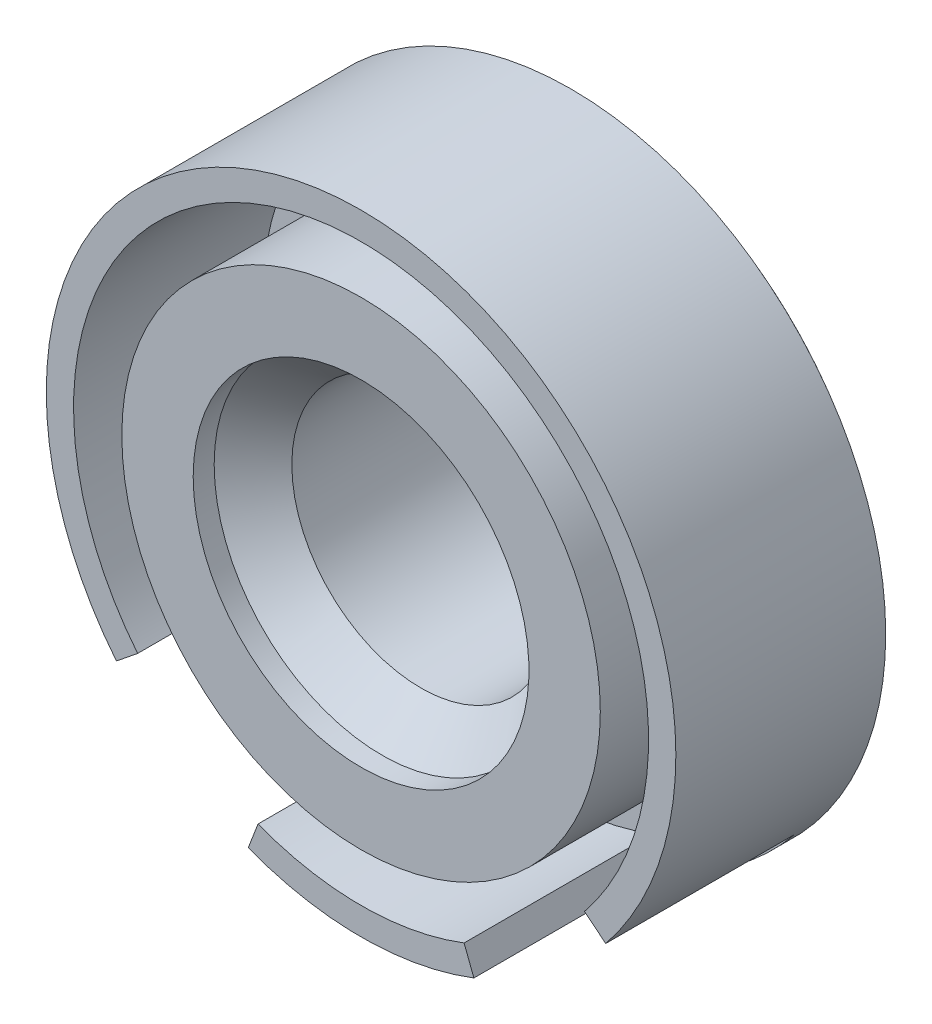
ISO-10303-21;
HEADER;
FILE_DESCRIPTION(('STEP AP214'),'2;1');
FILE_NAME('part.step','',(''),(''),'','','');
FILE_SCHEMA(('AUTOMOTIVE_DESIGN { 1 0 10303 214 1 1 1 1 }'));
ENDSEC;
DATA;
#1=APPLICATION_CONTEXT('core data for automotive mechanical design processes');
#2=APPLICATION_PROTOCOL_DEFINITION('international standard','automotive_design',2000,#1);
#3=PRODUCT_CONTEXT('',#1,'mechanical');
#4=PRODUCT('Part','Part','',(#3));
#5=PRODUCT_RELATED_PRODUCT_CATEGORY('part','',(#4));
#6=PRODUCT_DEFINITION_FORMATION('','',#4);
#7=PRODUCT_DEFINITION_CONTEXT('part definition',#1,'design');
#8=PRODUCT_DEFINITION('design','',#6,#7);
#9=PRODUCT_DEFINITION_SHAPE('','',#8);
#10=(LENGTH_UNIT() NAMED_UNIT(*) SI_UNIT(.MILLI.,.METRE.));
#11=(NAMED_UNIT(*) PLANE_ANGLE_UNIT() SI_UNIT($,.RADIAN.));
#12=(NAMED_UNIT(*) SI_UNIT($,.STERADIAN.) SOLID_ANGLE_UNIT());
#13=UNCERTAINTY_MEASURE_WITH_UNIT(LENGTH_MEASURE(1.E-05),#10,'distance_accuracy_value','');
#14=(GEOMETRIC_REPRESENTATION_CONTEXT(3) GLOBAL_UNCERTAINTY_ASSIGNED_CONTEXT((#13)) GLOBAL_UNIT_ASSIGNED_CONTEXT((#10,
#11,#12)) REPRESENTATION_CONTEXT('',''));
#15=CARTESIAN_POINT('',(0.,0.,0.));
#16=DIRECTION('',(0.,0.,1.));
#17=DIRECTION('',(1.,0.,0.));
#18=AXIS2_PLACEMENT_3D('',#15,#16,#17);
#19=CARTESIAN_POINT('',(0.,0.,0.));
#20=DIRECTION('',(0.,0.,-1.));
#21=DIRECTION('',(-1.,0.,0.));
#22=AXIS2_PLACEMENT_3D('',#19,#20,#21);
#23=CYLINDRICAL_SURFACE('',#22,15.);
#24=CARTESIAN_POINT('',(0.,0.,3.));
#25=DIRECTION('',(0.,0.,-1.));
#26=DIRECTION('',(-1.,0.,0.));
#27=AXIS2_PLACEMENT_3D('',#24,#25,#26);
#28=CIRCLE('',#27,15.);
#29=CARTESIAN_POINT('',(-15.,0.,3.));
#30=VERTEX_POINT('',#29);
#31=EDGE_CURVE('E175',#30,#30,#28,.T.);
#32=ORIENTED_EDGE('',*,*,#31,.F.);
#33=EDGE_LOOP('',(#32));
#34=FACE_BOUND('',#33,.T.);
#35=DIRECTION('',(0.,0.,1.));
#36=VECTOR('',#35,1.);
#37=CARTESIAN_POINT('',(-5.37551924317932,-14.0037063974581,4.));
#38=LINE('',#37,#36);
#39=CARTESIAN_POINT('',(-5.37551924317932,-14.0037063974581,4.));
#40=VERTEX_POINT('',#39);
#41=CARTESIAN_POINT('',(-5.37551924317932,-14.0037063974581,13.));
#42=VERTEX_POINT('',#41);
#43=EDGE_CURVE('E284',#40,#42,#38,.T.);
#44=ORIENTED_EDGE('',*,*,#43,.F.);
#45=CARTESIAN_POINT('',(0.,0.,4.));
#46=DIRECTION('',(0.,0.,-1.));
#47=DIRECTION('',(-0.309016994374958,0.95105651629515,0.));
#48=AXIS2_PLACEMENT_3D('',#45,#46,#47);
#49=CIRCLE('',#48,15.);
#50=CARTESIAN_POINT('',(-11.6571894218545,-9.4398058657477,4.));
#51=VERTEX_POINT('',#50);
#52=EDGE_CURVE('E285',#40,#51,#49,.T.);
#53=ORIENTED_EDGE('',*,*,#52,.T.);
#54=DIRECTION('',(0.,0.,1.));
#55=VECTOR('',#54,1.);
#56=CARTESIAN_POINT('',(-11.6571894218545,-9.4398058657477,4.));
#57=LINE('',#56,#55);
#58=CARTESIAN_POINT('',(-11.6571894218545,-9.4398058657477,13.));
#59=VERTEX_POINT('',#58);
#60=EDGE_CURVE('E568',#51,#59,#57,.T.);
#61=ORIENTED_EDGE('',*,*,#60,.T.);
#62=CARTESIAN_POINT('',(0.,0.,13.));
#63=DIRECTION('',(0.,0.,-1.));
#64=DIRECTION('',(-1.,0.,0.));
#65=AXIS2_PLACEMENT_3D('',#62,#63,#64);
#66=CIRCLE('',#65,15.);
#67=CARTESIAN_POINT('',(11.6571894218546,-9.43980586574754,13.));
#68=VERTEX_POINT('',#67);
#69=EDGE_CURVE('E159',#59,#68,#66,.T.);
#70=ORIENTED_EDGE('',*,*,#69,.T.);
#71=DIRECTION('',(0.,0.,1.));
#72=VECTOR('',#71,1.);
#73=CARTESIAN_POINT('',(11.6571894218546,-9.43980586574754,4.));
#74=LINE('',#73,#72);
#75=CARTESIAN_POINT('',(11.6571894218546,-9.43980586574754,4.));
#76=VERTEX_POINT('',#75);
#77=EDGE_CURVE('E311',#76,#68,#74,.T.);
#78=ORIENTED_EDGE('',*,*,#77,.F.);
#79=CARTESIAN_POINT('',(0.,0.,4.));
#80=DIRECTION('',(0.,0.,-1.));
#81=DIRECTION('',(-1.,0.,0.));
#82=AXIS2_PLACEMENT_3D('',#79,#80,#81);
#83=CIRCLE('',#82,15.);
#84=CARTESIAN_POINT('',(5.37551924317952,-14.003706397458,4.));
#85=VERTEX_POINT('',#84);
#86=EDGE_CURVE('E314',#76,#85,#83,.T.);
#87=ORIENTED_EDGE('',*,*,#86,.T.);
#88=DIRECTION('',(0.,0.,1.));
#89=VECTOR('',#88,1.);
#90=CARTESIAN_POINT('',(5.37551924317952,-14.003706397458,4.));
#91=LINE('',#90,#89);
#92=CARTESIAN_POINT('',(5.37551924317952,-14.003706397458,13.));
#93=VERTEX_POINT('',#92);
#94=EDGE_CURVE('E304',#85,#93,#91,.T.);
#95=ORIENTED_EDGE('',*,*,#94,.T.);
#96=EDGE_CURVE('E172',#93,#42,#66,.T.);
#97=ORIENTED_EDGE('',*,*,#96,.T.);
#98=EDGE_LOOP('',(#44,#53,#61,#70,#78,#87,#95,#97));
#99=FACE_BOUND('',#98,.T.);
#100=ADVANCED_FACE('F39',(#34,#99),#23,.T.);
#101=CARTESIAN_POINT('',(15.,0.,13.));
#102=DIRECTION('',(0.,0.,-1.));
#103=DIRECTION('',(-1.,0.,0.));
#104=AXIS2_PLACEMENT_3D('',#101,#102,#103);
#105=PLANE('',#104);
#106=DIRECTION('',(0.358367949545289,0.933580426497206,0.));
#107=VECTOR('',#106,1.);
#108=CARTESIAN_POINT('',(-5.37551924317932,-14.0037063974581,13.));
#109=LINE('',#108,#107);
#110=CARTESIAN_POINT('',(-4.90964090877044,-12.7900518430117,13.));
#111=VERTEX_POINT('',#110);
#112=EDGE_CURVE('E564',#42,#111,#109,.T.);
#113=ORIENTED_EDGE('',*,*,#112,.F.);
#114=ORIENTED_EDGE('',*,*,#96,.F.);
#115=DIRECTION('',(-0.3583679495453,0.933580426497202,0.));
#116=VECTOR('',#115,1.);
#117=CARTESIAN_POINT('',(5.37551924317952,-14.003706397458,13.));
#118=LINE('',#117,#116);
#119=CARTESIAN_POINT('',(4.90964090877062,-12.7900518430117,13.));
#120=VERTEX_POINT('',#119);
#121=EDGE_CURVE('E291',#93,#120,#118,.T.);
#122=ORIENTED_EDGE('',*,*,#121,.T.);
#123=CARTESIAN_POINT('',(0.,0.,13.));
#124=DIRECTION('',(0.,0.,-1.));
#125=DIRECTION('',(-1.,0.,0.));
#126=AXIS2_PLACEMENT_3D('',#123,#124,#125);
#127=CIRCLE('',#126,13.7);
#128=EDGE_CURVE('E164',#120,#111,#127,.T.);
#129=ORIENTED_EDGE('',*,*,#128,.T.);
#130=EDGE_LOOP('',(#113,#114,#122,#129));
#131=FACE_BOUND('',#130,.T.);
#132=ADVANCED_FACE('F273',(#131),#105,.F.);
#133=CARTESIAN_POINT('',(0.,0.,0.));
#134=DIRECTION('',(0.,0.,-1.));
#135=DIRECTION('',(-1.,0.,0.));
#136=AXIS2_PLACEMENT_3D('',#133,#134,#135);
#137=CYLINDRICAL_SURFACE('',#136,13.7);
#138=DIRECTION('',(0.,0.,-1.));
#139=VECTOR('',#138,1.);
#140=CARTESIAN_POINT('',(-4.90964090877044,-12.7900518430117,13.));
#141=LINE('',#140,#139);
#142=CARTESIAN_POINT('',(-4.90964090877044,-12.7900518430117,4.));
#143=VERTEX_POINT('',#142);
#144=EDGE_CURVE('E293',#111,#143,#141,.T.);
#145=ORIENTED_EDGE('',*,*,#144,.F.);
#146=ORIENTED_EDGE('',*,*,#128,.F.);
#147=DIRECTION('',(0.,0.,-1.));
#148=VECTOR('',#147,1.);
#149=CARTESIAN_POINT('',(4.90964090877062,-12.7900518430117,13.));
#150=LINE('',#149,#148);
#151=CARTESIAN_POINT('',(4.90964090877062,-12.7900518430117,4.));
#152=VERTEX_POINT('',#151);
#153=EDGE_CURVE('E299',#120,#152,#150,.T.);
#154=ORIENTED_EDGE('',*,*,#153,.T.);
#155=CARTESIAN_POINT('',(0.,0.,4.));
#156=DIRECTION('',(0.,0.,-1.));
#157=DIRECTION('',(-1.,0.,0.));
#158=AXIS2_PLACEMENT_3D('',#155,#156,#157);
#159=CIRCLE('',#158,13.7);
#160=EDGE_CURVE('E165',#152,#143,#159,.T.);
#161=ORIENTED_EDGE('',*,*,#160,.T.);
#162=EDGE_LOOP('',(#145,#146,#154,#161));
#163=FACE_BOUND('',#162,.T.);
#164=ADVANCED_FACE('F271',(#163),#137,.F.);
#165=ORIENTED_EDGE('',*,*,#69,.F.);
#166=DIRECTION('',(0.777145961456964,0.629320391049846,0.));
#167=VECTOR('',#166,1.);
#168=CARTESIAN_POINT('',(-11.6571894218545,-9.4398058657477,13.));
#169=LINE('',#168,#167);
#170=CARTESIAN_POINT('',(-10.6468996719604,-8.6216893573829,13.));
#171=VERTEX_POINT('',#170);
#172=EDGE_CURVE('E148',#59,#171,#169,.T.);
#173=ORIENTED_EDGE('',*,*,#172,.T.);
#174=CARTESIAN_POINT('',(10.6468996719605,-8.62168935738275,13.));
#175=VERTEX_POINT('',#174);
#176=EDGE_CURVE('E157',#171,#175,#127,.T.);
#177=ORIENTED_EDGE('',*,*,#176,.T.);
#178=DIRECTION('',(-0.777145961456972,0.629320391049837,0.));
#179=VECTOR('',#178,1.);
#180=CARTESIAN_POINT('',(11.6571894218546,-9.43980586574754,13.));
#181=LINE('',#180,#179);
#182=EDGE_CURVE('E306',#68,#175,#181,.T.);
#183=ORIENTED_EDGE('',*,*,#182,.F.);
#184=EDGE_LOOP('',(#165,#173,#177,#183));
#185=FACE_BOUND('',#184,.T.);
#186=ADVANCED_FACE('F155',(#185),#105,.F.);
#187=ORIENTED_EDGE('',*,*,#176,.F.);
#188=DIRECTION('',(0.,0.,-1.));
#189=VECTOR('',#188,1.);
#190=CARTESIAN_POINT('',(-10.6468996719604,-8.6216893573829,13.));
#191=LINE('',#190,#189);
#192=CARTESIAN_POINT('',(-10.6468996719604,-8.6216893573829,4.));
#193=VERTEX_POINT('',#192);
#194=EDGE_CURVE('E144',#171,#193,#191,.T.);
#195=ORIENTED_EDGE('',*,*,#194,.T.);
#196=CARTESIAN_POINT('',(10.6468996719605,-8.62168935738275,4.));
#197=VERTEX_POINT('',#196);
#198=EDGE_CURVE('E63',#193,#197,#159,.T.);
#199=ORIENTED_EDGE('',*,*,#198,.T.);
#200=DIRECTION('',(0.,0.,-1.));
#201=VECTOR('',#200,1.);
#202=CARTESIAN_POINT('',(10.6468996719605,-8.62168935738275,13.));
#203=LINE('',#202,#201);
#204=EDGE_CURVE('E163',#175,#197,#203,.T.);
#205=ORIENTED_EDGE('',*,*,#204,.F.);
#206=EDGE_LOOP('',(#187,#195,#199,#205));
#207=FACE_BOUND('',#206,.T.);
#208=ADVANCED_FACE('F161',(#207),#137,.F.);
#209=CARTESIAN_POINT('',(0.,0.,14.55375));
#210=DIRECTION('',(0.,0.,-1.));
#211=DIRECTION('',(-1.,0.,0.));
#212=AXIS2_PLACEMENT_3D('',#209,#210,#211);
#213=DEGENERATE_TOROIDAL_SURFACE('',#212,6.15,14.55375,.T.);
#214=ORIENTED_EDGE('',*,*,#31,.T.);
#215=EDGE_LOOP('',(#214));
#216=FACE_BOUND('',#215,.T.);
#217=CARTESIAN_POINT('',(0.000199999999999133,-8.19848929254652,0.144887079185334));
#218=CARTESIAN_POINT('',(-0.29528264045718,-8.02789231053771,0.120669376140864));
#219=CARTESIAN_POINT('',(-0.591029998880676,-7.85714249353978,0.10173044828733));
#220=CARTESIAN_POINT('',(-1.18275713374159,-7.51550867294103,0.071911056873235));
#221=CARTESIAN_POINT('',(-1.47873682498981,-7.3446247185242,0.0610284009512895));
#222=CARTESIAN_POINT('',(-2.07056602903552,-7.00293196825413,0.0448182165877884));
#223=CARTESIAN_POINT('',(-2.36641546795173,-6.83212321505626,0.0394864405018354));
#224=CARTESIAN_POINT('',(-2.95817660239539,-6.49046976478925,0.0325965580271773));
#225=CARTESIAN_POINT('',(-3.25408830119769,-6.31962506582938,0.0310388528863203));
#226=CARTESIAN_POINT('',(-3.84591169880231,-5.97793566790964,0.0310388528863202));
#227=CARTESIAN_POINT('',(-4.14182339760461,-5.80709096894977,0.0325965580271772));
#228=CARTESIAN_POINT('',(-4.73358453204827,-5.46543751868277,0.0394864405018352));
#229=CARTESIAN_POINT('',(-5.02943397096448,-5.29462876548489,0.0448182165877883));
#230=CARTESIAN_POINT('',(-5.62126317501019,-4.95293601521482,0.0610284009512893));
#231=CARTESIAN_POINT('',(-5.91724286625841,-4.782052060798,0.0719110568732348));
#232=CARTESIAN_POINT('',(-6.50897000111932,-4.44041824019924,0.10173044828733));
#233=CARTESIAN_POINT('',(-6.80471735954282,-4.26966842320132,0.120669376140864));
#234=CARTESIAN_POINT('',(-7.1002,-4.0990714411925,0.144887079185334));
#235=B_SPLINE_CURVE_WITH_KNOTS('',3,(#217,#218,#219,#220,#221,#222,#223,#224,#225,#226,#227,
#228,#229,#230,#231,#232,#233,#234),.UNSPECIFIED.,.F.,.F.,(4,2,2,2,2,2,2,2,4),(0.,
1.02601845770728,2.05175760123721,3.07671125041731,4.10177386479939,5.12683647918148,
6.15179012836157,7.1775292718915,8.20354772959878),.UNSPECIFIED.);
#236=CARTESIAN_POINT('',(0.,-8.19837382249268,0.144870663083245));
#237=VERTEX_POINT('',#236);
#238=CARTESIAN_POINT('',(-7.1,-4.09918691124671,0.14487066308327));
#239=VERTEX_POINT('',#238);
#240=EDGE_CURVE('E11',#237,#239,#235,.T.);
#241=ORIENTED_EDGE('',*,*,#240,.F.);
#242=CARTESIAN_POINT('',(7.1002,-4.0990714411925,0.144887079185334));
#243=CARTESIAN_POINT('',(6.80471735954282,-4.26966842320132,0.120669376140866));
#244=CARTESIAN_POINT('',(6.50897000111932,-4.44041824019924,0.101730448287332));
#245=CARTESIAN_POINT('',(5.91724286625841,-4.782052060798,0.0719110568732352));
#246=CARTESIAN_POINT('',(5.62126317501018,-4.95293601521482,0.0610284009512883));
#247=CARTESIAN_POINT('',(5.02943397096448,-5.29462876548489,0.0448182165877873));
#248=CARTESIAN_POINT('',(4.73358453204827,-5.46543751868277,0.0394864405018357));
#249=CARTESIAN_POINT('',(4.14182339760461,-5.80709096894977,0.0325965580271779));
#250=CARTESIAN_POINT('',(3.8459116988023,-5.97793566790964,0.0310388528863195));
#251=CARTESIAN_POINT('',(3.25408830119769,-6.31962506582938,0.0310388528863186));
#252=CARTESIAN_POINT('',(2.95817660239539,-6.49046976478925,0.0325965580271761));
#253=CARTESIAN_POINT('',(2.36641546795173,-6.83212321505626,0.0394864405018346));
#254=CARTESIAN_POINT('',(2.07056602903552,-7.00293196825413,0.0448182165877877));
#255=CARTESIAN_POINT('',(1.47873682498981,-7.3446247185242,0.0610284009512891));
#256=CARTESIAN_POINT('',(1.18275713374159,-7.51550867294103,0.0719110568732349));
#257=CARTESIAN_POINT('',(0.591029998880674,-7.85714249353978,0.101730448287331));
#258=CARTESIAN_POINT('',(0.295282640457178,-8.02789231053771,0.120669376140865));
#259=CARTESIAN_POINT('',(-0.00020000000000144,-8.19848929254652,0.144887079185336));
#260=B_SPLINE_CURVE_WITH_KNOTS('',3,(#242,#243,#244,#245,#246,#247,#248,#249,#250,#251,#252,
#253,#254,#255,#256,#257,#258,#259),.UNSPECIFIED.,.F.,.F.,(4,2,2,2,2,2,2,2,4),(0.,
1.02601845770728,2.05175760123721,3.07671125041731,4.10177386479939,5.12683647918148,
6.15179012836157,7.1775292718915,8.20354772959878),.UNSPECIFIED.);
#261=CARTESIAN_POINT('',(7.1,-4.09918691124634,0.144870663083242));
#262=VERTEX_POINT('',#261);
#263=EDGE_CURVE('E48',#262,#237,#260,.T.);
#264=ORIENTED_EDGE('',*,*,#263,.F.);
#265=CARTESIAN_POINT('',(7.1,12.6704623007954,2.65058091083974));
#266=CARTESIAN_POINT('',(7.1,12.4776198193147,2.53222329168504));
#267=CARTESIAN_POINT('',(7.1,12.2821370824386,2.4182313729075));
#268=CARTESIAN_POINT('',(7.1,11.8863368754396,2.19902573682189));
#269=CARTESIAN_POINT('',(7.1,11.6860199379336,2.0938110581067));
#270=CARTESIAN_POINT('',(7.1,11.0784050371805,1.79135713460136));
#271=CARTESIAN_POINT('',(7.1,10.6644591687302,1.60731789709107));
#272=CARTESIAN_POINT('',(7.1,9.82690894927955,1.27588359119623));
#273=CARTESIAN_POINT('',(7.1,9.40343843445672,1.12814814997598));
#274=CARTESIAN_POINT('',(7.1,8.76098683986701,0.931388384733824));
#275=CARTESIAN_POINT('',(7.1,8.5457191135165,0.86996261916167));
#276=CARTESIAN_POINT('',(7.1,8.11305556633534,0.755069392193106));
#277=CARTESIAN_POINT('',(7.1,7.8956596737245,0.701602200221307));
#278=CARTESIAN_POINT('',(7.1,7.41446479731436,0.592145991935776));
#279=CARTESIAN_POINT('',(7.1,7.15027420527234,0.537880127752605));
#280=CARTESIAN_POINT('',(7.1,6.61997133771649,0.439708794424213));
#281=CARTESIAN_POINT('',(7.1,6.35385893638693,0.395804010045602));
#282=CARTESIAN_POINT('',(7.1,5.8201149523072,0.317448726636421));
#283=CARTESIAN_POINT('',(7.1,5.5524826489505,0.283003175511258));
#284=CARTESIAN_POINT('',(7.1,5.01629438017879,0.222545996754257));
#285=CARTESIAN_POINT('',(7.1,4.74773845699944,0.196533988518943));
#286=CARTESIAN_POINT('',(7.1,3.93896950772074,0.1291752182786));
#287=CARTESIAN_POINT('',(7.1,3.3978447922965,0.0988075833107552));
#288=CARTESIAN_POINT('',(7.1,2.58568150428845,0.0673284048710562));
#289=CARTESIAN_POINT('',(7.1,2.31483865220188,0.0591805512509537));
#290=CARTESIAN_POINT('',(7.1,1.773067935499,0.0463799673007081));
#291=CARTESIAN_POINT('',(7.1,1.50214007242913,0.0417271767049797));
#292=CARTESIAN_POINT('',(7.1,0.956836357763326,0.0349473933737687));
#293=CARTESIAN_POINT('',(7.1,0.682460169283732,0.0328530387112459));
#294=CARTESIAN_POINT('',(7.1,0.13373291814798,0.030767315839323));
#295=CARTESIAN_POINT('',(7.1,-0.140618143520391,0.0307756926464719));
#296=CARTESIAN_POINT('',(7.1,-0.689369260137921,0.0328975350574007));
#297=CARTESIAN_POINT('',(7.1,-0.963769313502615,0.0350114354477543));
#298=CARTESIAN_POINT('',(7.1,-1.51254722529568,0.0418792491908552));
#299=CARTESIAN_POINT('',(7.1,-1.78692508279953,0.0466332425399696));
#300=CARTESIAN_POINT('',(7.1,-2.33475827135327,0.0597298141365401));
#301=CARTESIAN_POINT('',(7.1,-2.60821385156525,0.0680613448341024));
#302=CARTESIAN_POINT('',(7.1,-3.15493359350109,0.0895461170287176));
#303=CARTESIAN_POINT('',(7.1,-3.42819776171314,0.102699186294393));
#304=CARTESIAN_POINT('',(7.1,-3.97426272609955,0.13517159889011));
#305=CARTESIAN_POINT('',(7.1,-4.24706366132132,0.154488537943908));
#306=CARTESIAN_POINT('',(7.1,-4.7920224832147,0.200624383504621));
#307=CARTESIAN_POINT('',(7.1,-5.06418041766798,0.227442713689355));
#308=CARTESIAN_POINT('',(7.1,-5.58624628080763,0.28737425418407));
#309=CARTESIAN_POINT('',(7.1,-5.83622890702702,0.319830718302098));
#310=CARTESIAN_POINT('',(7.1,-6.33500263367075,0.393019527471743));
#311=CARTESIAN_POINT('',(7.1,-6.58379366676196,0.43375233467534));
#312=CARTESIAN_POINT('',(7.1,-7.07984538741963,0.524245190996732));
#313=CARTESIAN_POINT('',(7.1,-7.32710542257737,0.574008846907034));
#314=CARTESIAN_POINT('',(7.1,-7.81947861406452,0.683145032400615));
#315=CARTESIAN_POINT('',(7.1,-8.06459182799195,0.742517303352489));
#316=CARTESIAN_POINT('',(7.1,-8.7903314483637,0.93433124404538));
#317=CARTESIAN_POINT('',(7.1,-9.26717888792823,1.08150544461771));
#318=CARTESIAN_POINT('',(7.1,-10.2056430392395,1.41779328261507));
#319=CARTESIAN_POINT('',(7.1,-10.6672687324595,1.6068816611538));
#320=CARTESIAN_POINT('',(7.1,-11.3842364089217,1.94099663775663));
#321=CARTESIAN_POINT('',(7.1,-11.6461549494839,2.07204533142524));
#322=CARTESIAN_POINT('',(7.1,-12.1637302833675,2.34972048160825));
#323=CARTESIAN_POINT('',(7.1,-12.4193370395519,2.49644015698685));
#324=CARTESIAN_POINT('',(7.1,-12.6704623007954,2.65058091083973));
#325=B_SPLINE_CURVE_WITH_KNOTS('',3,(#265,#266,#267,#268,#269,#270,#271,#272,#273,#274,#275,
#276,#277,#278,#279,#280,#281,#282,#283,#284,#285,#286,#287,#288,#289,#290,#291,#292,#293,#294,
#295,#296,#297,#298,#299,#300,#301,#302,#303,#304,#305,#306,#307,#308,#309,#310,#311,#312,#313,
#314,#315,#316,#317,#318,#319,#320,#321,#322,#323,#324),.UNSPECIFIED.,.F.,.F.,(4,2,2,2,2,2,2,2,
2,2,2,2,2,2,2,2,2,2,2,2,2,2,2,2,2,2,2,2,2,4),(0.,0.678681352088731,1.35728826754796,
2.71455880286389,4.05857182846413,4.73002368779465,5.40149827287249,6.21038842317986,
7.01933201829703,7.82869795052617,8.63802735120692,10.2633067696646,11.0762007310504,
11.8890806753341,12.712225770233,13.535271048166,14.35848631861,15.1817265343212,
16.0024426365105,16.8231294245524,17.6434964863902,18.4638005377912,19.2199188064839,
19.9760793085195,20.7325424776109,21.4889852886587,22.9841857630959,24.4784876176004,
25.3566727995502,26.2404082255461),.UNSPECIFIED.);
#326=CARTESIAN_POINT('',(7.1,4.09918691124634,0.144870663083221));
#327=VERTEX_POINT('',#326);
#328=EDGE_CURVE('E239',#327,#262,#325,.T.);
#329=ORIENTED_EDGE('',*,*,#328,.F.);
#330=CARTESIAN_POINT('',(-0.000200000000000867,8.19848929254652,0.144887079185335));
#331=CARTESIAN_POINT('',(0.295282640457179,8.02789231053771,0.120669376140864));
#332=CARTESIAN_POINT('',(0.591029998880675,7.85714249353978,0.10173044828733));
#333=CARTESIAN_POINT('',(1.18275713374159,7.51550867294103,0.0719110568732352));
#334=CARTESIAN_POINT('',(1.47873682498981,7.34462471852421,0.0610284009512904));
#335=CARTESIAN_POINT('',(2.07056602903552,7.00293196825413,0.0448182165877894));
#336=CARTESIAN_POINT('',(2.36641546795173,6.83212321505626,0.0394864405018357));
#337=CARTESIAN_POINT('',(2.95817660239539,6.49046976478926,0.0325965580271765));
#338=CARTESIAN_POINT('',(3.25408830119769,6.31962506582938,0.0310388528863189));
#339=CARTESIAN_POINT('',(3.8459116988023,5.97793566790964,0.0310388528863195));
#340=CARTESIAN_POINT('',(4.14182339760461,5.80709096894977,0.0325965580271778));
#341=CARTESIAN_POINT('',(4.73358453204826,5.46543751868277,0.039486440501836));
#342=CARTESIAN_POINT('',(5.02943397096448,5.29462876548489,0.044818216587788));
#343=CARTESIAN_POINT('',(5.62126317501018,4.95293601521482,0.0610284009512886));
#344=CARTESIAN_POINT('',(5.91724286625841,4.782052060798,0.0719110568732347));
#345=CARTESIAN_POINT('',(6.50897000111932,4.44041824019924,0.101730448287331));
#346=CARTESIAN_POINT('',(6.80471735954282,4.26966842320132,0.120669376140865));
#347=CARTESIAN_POINT('',(7.1002,4.0990714411925,0.144887079185335));
#348=B_SPLINE_CURVE_WITH_KNOTS('',3,(#330,#331,#332,#333,#334,#335,#336,#337,#338,#339,#340,
#341,#342,#343,#344,#345,#346,#347),.UNSPECIFIED.,.F.,.F.,(4,2,2,2,2,2,2,2,4),(0.,
1.02601845770728,2.05175760123721,3.07671125041731,4.10177386479939,5.12683647918147,
6.15179012836157,7.1775292718915,8.20354772959878),.UNSPECIFIED.);
#349=CARTESIAN_POINT('',(0.,8.19837382249269,0.144870663081931));
#350=VERTEX_POINT('',#349);
#351=EDGE_CURVE('E233',#350,#327,#348,.T.);
#352=ORIENTED_EDGE('',*,*,#351,.F.);
#353=CARTESIAN_POINT('',(-7.1002,4.09907144119251,0.144887079185336));
#354=CARTESIAN_POINT('',(-6.80471735954282,4.26966842320132,0.120669376140865));
#355=CARTESIAN_POINT('',(-6.50897000111932,4.44041824019925,0.101730448287331));
#356=CARTESIAN_POINT('',(-5.91724286625841,4.782052060798,0.0719110568732361));
#357=CARTESIAN_POINT('',(-5.62126317501018,4.95293601521483,0.0610284009512912));
#358=CARTESIAN_POINT('',(-5.02943397096448,5.29462876548489,0.0448182165877899));
#359=CARTESIAN_POINT('',(-4.73358453204827,5.46543751868277,0.0394864405018359));
#360=CARTESIAN_POINT('',(-4.14182339760461,5.80709096894977,0.0325965580271767));
#361=CARTESIAN_POINT('',(-3.84591169880231,5.97793566790964,0.0310388528863194));
#362=CARTESIAN_POINT('',(-3.25408830119769,6.31962506582938,0.0310388528863193));
#363=CARTESIAN_POINT('',(-2.95817660239539,6.49046976478926,0.0325965580271765));
#364=CARTESIAN_POINT('',(-2.36641546795173,6.83212321505626,0.0394864405018354));
#365=CARTESIAN_POINT('',(-2.07056602903552,7.00293196825413,0.0448182165877892));
#366=CARTESIAN_POINT('',(-1.47873682498982,7.3446247185242,0.0610284009512903));
#367=CARTESIAN_POINT('',(-1.18275713374159,7.51550867294103,0.0719110568732351));
#368=CARTESIAN_POINT('',(-0.591029998880678,7.85714249353978,0.101730448287329));
#369=CARTESIAN_POINT('',(-0.295282640457183,8.02789231053771,0.120669376140863));
#370=CARTESIAN_POINT('',(0.000199999999997749,8.19848929254652,0.144887079185334));
#371=B_SPLINE_CURVE_WITH_KNOTS('',3,(#353,#354,#355,#356,#357,#358,#359,#360,#361,#362,#363,
#364,#365,#366,#367,#368,#369,#370),.UNSPECIFIED.,.F.,.F.,(4,2,2,2,2,2,2,2,4),(0.,
1.02601845770728,2.05175760123721,3.0767112504173,4.10177386479939,5.12683647918147,
6.15179012836157,7.17752927189149,8.20354772959878),.UNSPECIFIED.);
#372=CARTESIAN_POINT('',(-7.1,4.09918691124634,0.144870663083242));
#373=VERTEX_POINT('',#372);
#374=EDGE_CURVE('E201',#373,#350,#371,.T.);
#375=ORIENTED_EDGE('',*,*,#374,.F.);
#376=CARTESIAN_POINT('',(-7.1,-12.6704623007954,2.65058091083974));
#377=CARTESIAN_POINT('',(-7.1,-12.4776198193147,2.53222329168505));
#378=CARTESIAN_POINT('',(-7.1,-12.2821370824386,2.4182313729075));
#379=CARTESIAN_POINT('',(-7.1,-11.8863368754396,2.1990257368219));
#380=CARTESIAN_POINT('',(-7.1,-11.6860199379336,2.0938110581067));
#381=CARTESIAN_POINT('',(-7.1,-11.0784050371805,1.79135713460136));
#382=CARTESIAN_POINT('',(-7.1,-10.6644591687302,1.60731789709108));
#383=CARTESIAN_POINT('',(-7.1,-9.82690894927955,1.27588359119624));
#384=CARTESIAN_POINT('',(-7.1,-9.40343843445672,1.12814814997598));
#385=CARTESIAN_POINT('',(-7.1,-8.76098683986701,0.931388384733826));
#386=CARTESIAN_POINT('',(-7.1,-8.54571911351649,0.869962619161673));
#387=CARTESIAN_POINT('',(-7.1,-8.11305556633534,0.755069392193107));
#388=CARTESIAN_POINT('',(-7.1,-7.89565967372449,0.701602200221306));
#389=CARTESIAN_POINT('',(-7.1,-7.41446479731436,0.592145991935776));
#390=CARTESIAN_POINT('',(-7.1,-7.15027420527234,0.537880127752608));
#391=CARTESIAN_POINT('',(-7.1,-6.61997133771648,0.439708794424218));
#392=CARTESIAN_POINT('',(-7.1,-6.35385893638693,0.395804010045605));
#393=CARTESIAN_POINT('',(-7.1,-5.8201149523072,0.317448726636423));
#394=CARTESIAN_POINT('',(-7.1,-5.5524826489505,0.283003175511261));
#395=CARTESIAN_POINT('',(-7.1,-5.01629438017879,0.222545996754261));
#396=CARTESIAN_POINT('',(-7.1,-4.74773845699944,0.196533988518947));
#397=CARTESIAN_POINT('',(-7.1,-3.93896950772074,0.129175218278604));
#398=CARTESIAN_POINT('',(-7.1,-3.3978447922965,0.0988075833107579));
#399=CARTESIAN_POINT('',(-7.1,-2.58568150428845,0.0673284048710588));
#400=CARTESIAN_POINT('',(-7.1,-2.31483865220188,0.0591805512509565));
#401=CARTESIAN_POINT('',(-7.1,-1.773067935499,0.0463799673007114));
#402=CARTESIAN_POINT('',(-7.1,-1.50214007242912,0.0417271767049834));
#403=CARTESIAN_POINT('',(-7.1,-0.956836357763323,0.0349473933737724));
#404=CARTESIAN_POINT('',(-7.1,-0.682460169283729,0.0328530387112493));
#405=CARTESIAN_POINT('',(-7.1,-0.133732918147976,0.0307673158393256));
#406=CARTESIAN_POINT('',(-7.1,0.140618143520395,0.030775692646474));
#407=CARTESIAN_POINT('',(-7.1,0.689369260137927,0.0328975350574038));
#408=CARTESIAN_POINT('',(-7.1,0.963769313502622,0.0350114354477588));
#409=CARTESIAN_POINT('',(-7.1,1.51254722529568,0.0418792491908602));
#410=CARTESIAN_POINT('',(-7.1,1.78692508279953,0.0466332425399736));
#411=CARTESIAN_POINT('',(-7.1,2.33475827135328,0.0597298141365441));
#412=CARTESIAN_POINT('',(-7.1,2.60821385156526,0.0680613448341072));
#413=CARTESIAN_POINT('',(-7.1,3.1549335935011,0.0895461170287223));
#414=CARTESIAN_POINT('',(-7.1,3.42819776171314,0.102699186294397));
#415=CARTESIAN_POINT('',(-7.1,3.97426272609956,0.135171598890114));
#416=CARTESIAN_POINT('',(-7.1,4.24706366132133,0.154488537943914));
#417=CARTESIAN_POINT('',(-7.1,4.79202248321471,0.200624383504623));
#418=CARTESIAN_POINT('',(-7.1,5.06418041766799,0.227442713689354));
#419=CARTESIAN_POINT('',(-7.1,5.58624628080764,0.28737425418407));
#420=CARTESIAN_POINT('',(-7.1,5.83622890702703,0.319830718302103));
#421=CARTESIAN_POINT('',(-7.1,6.33500263367076,0.393019527471751));
#422=CARTESIAN_POINT('',(-7.1,6.58379366676196,0.433752334675344));
#423=CARTESIAN_POINT('',(-7.1,7.07984538741964,0.524245190996734));
#424=CARTESIAN_POINT('',(-7.1,7.32710542257737,0.574008846907037));
#425=CARTESIAN_POINT('',(-7.1,7.81947861406452,0.683145032400618));
#426=CARTESIAN_POINT('',(-7.1,8.06459182799195,0.742517303352491));
#427=CARTESIAN_POINT('',(-7.1,8.7903314483637,0.934331244045382));
#428=CARTESIAN_POINT('',(-7.1,9.26717888792824,1.08150544461771));
#429=CARTESIAN_POINT('',(-7.1,10.2056430392395,1.41779328261507));
#430=CARTESIAN_POINT('',(-7.1,10.6672687324595,1.60688166115381));
#431=CARTESIAN_POINT('',(-7.1,11.3842364089217,1.94099663775664));
#432=CARTESIAN_POINT('',(-7.1,11.6461549494839,2.07204533142525));
#433=CARTESIAN_POINT('',(-7.1,12.1637302833675,2.34972048160826));
#434=CARTESIAN_POINT('',(-7.1,12.4193370395519,2.49644015698686));
#435=CARTESIAN_POINT('',(-7.1,12.6704623007954,2.65058091083974));
#436=B_SPLINE_CURVE_WITH_KNOTS('',3,(#376,#377,#378,#379,#380,#381,#382,#383,#384,#385,#386,
#387,#388,#389,#390,#391,#392,#393,#394,#395,#396,#397,#398,#399,#400,#401,#402,#403,#404,#405,
#406,#407,#408,#409,#410,#411,#412,#413,#414,#415,#416,#417,#418,#419,#420,#421,#422,#423,#424,
#425,#426,#427,#428,#429,#430,#431,#432,#433,#434,#435),.UNSPECIFIED.,.F.,.F.,(4,2,2,2,2,2,2,2,
2,2,2,2,2,2,2,2,2,2,2,2,2,2,2,2,2,2,2,2,2,4),(0.,0.678681352088728,1.35728826754796,
2.71455880286389,4.05857182846413,4.73002368779465,5.40149827287249,6.21038842317986,
7.01933201829703,7.82869795052617,8.63802735120692,10.2633067696646,11.0762007310504,
11.8890806753341,12.712225770233,13.535271048166,14.35848631861,15.1817265343212,
16.0024426365105,16.8231294245524,17.6434964863902,18.4638005377912,19.2199188064839,
19.9760793085195,20.7325424776109,21.4889852886587,22.9841857630959,24.4784876176004,
25.3566727995502,26.2404082255461),.UNSPECIFIED.);
#437=EDGE_CURVE('E193',#239,#373,#436,.T.);
#438=ORIENTED_EDGE('',*,*,#437,.F.);
#439=EDGE_LOOP('',(#241,#264,#329,#352,#375,#438));
#440=FACE_BOUND('',#439,.T.);
#441=ADVANCED_FACE('F208',(#216,#440),#213,.T.);
#442=CARTESIAN_POINT('',(0.,0.,0.));
#443=DIRECTION('',(0.,0.,-1.));
#444=DIRECTION('',(-1.,0.,0.));
#445=AXIS2_PLACEMENT_3D('',#442,#443,#444);
#446=CYLINDRICAL_SURFACE('',#445,11.4);
#447=CARTESIAN_POINT('',(0.,0.,4.));
#448=DIRECTION('',(0.,0.,-1.));
#449=DIRECTION('',(-1.,0.,0.));
#450=AXIS2_PLACEMENT_3D('',#447,#448,#449);
#451=CIRCLE('',#450,11.4);
#452=CARTESIAN_POINT('',(-11.4,0.,4.));
#453=VERTEX_POINT('',#452);
#454=EDGE_CURVE('E349',#453,#453,#451,.T.);
#455=ORIENTED_EDGE('',*,*,#454,.F.);
#456=EDGE_LOOP('',(#455));
#457=FACE_BOUND('',#456,.T.);
#458=CARTESIAN_POINT('',(0.,0.,13.));
#459=DIRECTION('',(0.,0.,-1.));
#460=DIRECTION('',(-1.,0.,0.));
#461=AXIS2_PLACEMENT_3D('',#458,#459,#460);
#462=CIRCLE('',#461,11.4);
#463=CARTESIAN_POINT('',(-11.4,0.,13.));
#464=VERTEX_POINT('',#463);
#465=EDGE_CURVE('E190',#464,#464,#462,.T.);
#466=ORIENTED_EDGE('',*,*,#465,.T.);
#467=EDGE_LOOP('',(#466));
#468=FACE_BOUND('',#467,.T.);
#469=ADVANCED_FACE('F41',(#457,#468),#446,.T.);
#470=CARTESIAN_POINT('',(11.4,0.,13.));
#471=DIRECTION('',(0.,0.,-1.));
#472=DIRECTION('',(-1.,0.,0.));
#473=AXIS2_PLACEMENT_3D('',#470,#471,#472);
#474=PLANE('',#473);
#475=ORIENTED_EDGE('',*,*,#465,.F.);
#476=EDGE_LOOP('',(#475));
#477=FACE_BOUND('',#476,.T.);
#478=CARTESIAN_POINT('',(0.,0.,13.));
#479=DIRECTION('',(0.,0.,-1.));
#480=DIRECTION('',(-1.,0.,0.));
#481=AXIS2_PLACEMENT_3D('',#478,#479,#480);
#482=CIRCLE('',#481,8.);
#483=CARTESIAN_POINT('',(-8.,0.,13.));
#484=VERTEX_POINT('',#483);
#485=EDGE_CURVE('E186',#484,#484,#482,.T.);
#486=ORIENTED_EDGE('',*,*,#485,.T.);
#487=EDGE_LOOP('',(#486));
#488=FACE_BOUND('',#487,.T.);
#489=ADVANCED_FACE('F486',(#477,#488),#474,.F.);
#490=CARTESIAN_POINT('',(0.,0.,0.));
#491=DIRECTION('',(0.,0.,-1.));
#492=DIRECTION('',(-1.,0.,0.));
#493=AXIS2_PLACEMENT_3D('',#490,#491,#492);
#494=CYLINDRICAL_SURFACE('',#493,8.);
#495=ORIENTED_EDGE('',*,*,#485,.F.);
#496=EDGE_LOOP('',(#495));
#497=FACE_BOUND('',#496,.T.);
#498=CARTESIAN_POINT('',(0.,0.,12.));
#499=DIRECTION('',(0.,0.,-1.));
#500=DIRECTION('',(-1.,0.,0.));
#501=AXIS2_PLACEMENT_3D('',#498,#499,#500);
#502=CIRCLE('',#501,8.);
#503=CARTESIAN_POINT('',(-8.,0.,12.));
#504=VERTEX_POINT('',#503);
#505=EDGE_CURVE('E182',#504,#504,#502,.T.);
#506=ORIENTED_EDGE('',*,*,#505,.T.);
#507=EDGE_LOOP('',(#506));
#508=FACE_BOUND('',#507,.T.);
#509=ADVANCED_FACE('F493',(#497,#508),#494,.F.);
#510=CARTESIAN_POINT('',(0.,0.,10.15));
#511=DIRECTION('',(0.,0.,1.));
#512=DIRECTION('',(1.,0.,0.));
#513=AXIS2_PLACEMENT_3D('',#510,#511,#512);
#514=CONICAL_SURFACE('',#513,6.15,0.785398163397444);
#515=ORIENTED_EDGE('',*,*,#505,.F.);
#516=EDGE_LOOP('',(#515));
#517=FACE_BOUND('',#516,.T.);
#518=CARTESIAN_POINT('',(0.,0.,10.15));
#519=DIRECTION('',(0.,0.,-1.));
#520=DIRECTION('',(-1.,0.,0.));
#521=AXIS2_PLACEMENT_3D('',#518,#519,#520);
#522=CIRCLE('',#521,6.15);
#523=CARTESIAN_POINT('',(-6.15,0.,10.15));
#524=VERTEX_POINT('',#523);
#525=EDGE_CURVE('E178',#524,#524,#522,.T.);
#526=ORIENTED_EDGE('',*,*,#525,.T.);
#527=EDGE_LOOP('',(#526));
#528=FACE_BOUND('',#527,.T.);
#529=ADVANCED_FACE('F500',(#517,#528),#514,.F.);
#530=CARTESIAN_POINT('',(0.,0.,0.));
#531=DIRECTION('',(0.,0.,-1.));
#532=DIRECTION('',(-1.,0.,0.));
#533=AXIS2_PLACEMENT_3D('',#530,#531,#532);
#534=CYLINDRICAL_SURFACE('',#533,6.15);
#535=CARTESIAN_POINT('',(0.,0.,2.5));
#536=DIRECTION('',(0.,0.,1.));
#537=DIRECTION('',(1.,0.,0.));
#538=AXIS2_PLACEMENT_3D('',#535,#536,#537);
#539=CIRCLE('',#538,6.15);
#540=CARTESIAN_POINT('',(6.15,0.,2.5));
#541=VERTEX_POINT('',#540);
#542=EDGE_CURVE('E43',#541,#541,#539,.F.);
#543=ORIENTED_EDGE('',*,*,#542,.T.);
#544=EDGE_LOOP('',(#543));
#545=FACE_BOUND('',#544,.T.);
#546=ORIENTED_EDGE('',*,*,#525,.F.);
#547=EDGE_LOOP('',(#546));
#548=FACE_BOUND('',#547,.T.);
#549=ADVANCED_FACE('F268',(#545,#548),#534,.F.);
#550=CARTESIAN_POINT('',(13.7,0.,4.));
#551=DIRECTION('',(0.,0.,-1.));
#552=DIRECTION('',(-1.,0.,0.));
#553=AXIS2_PLACEMENT_3D('',#550,#551,#552);
#554=PLANE('',#553);
#555=ORIENTED_EDGE('',*,*,#160,.F.);
#556=DIRECTION('',(-0.358367949545301,0.933580426497201,0.));
#557=VECTOR('',#556,1.);
#558=CARTESIAN_POINT('',(5.37551924317952,-14.003706397458,4.));
#559=LINE('',#558,#557);
#560=EDGE_CURVE('E302',#85,#152,#559,.T.);
#561=ORIENTED_EDGE('',*,*,#560,.F.);
#562=ORIENTED_EDGE('',*,*,#86,.F.);
#563=DIRECTION('',(-0.777145961456972,0.629320391049836,0.));
#564=VECTOR('',#563,1.);
#565=CARTESIAN_POINT('',(11.6571894218546,-9.43980586574754,4.));
#566=LINE('',#565,#564);
#567=EDGE_CURVE('E309',#76,#197,#566,.T.);
#568=ORIENTED_EDGE('',*,*,#567,.T.);
#569=ORIENTED_EDGE('',*,*,#198,.F.);
#570=DIRECTION('',(0.777145961456963,0.629320391049847,0.));
#571=VECTOR('',#570,1.);
#572=CARTESIAN_POINT('',(-11.6571894218545,-9.4398058657477,4.));
#573=LINE('',#572,#571);
#574=EDGE_CURVE('E150',#51,#193,#573,.T.);
#575=ORIENTED_EDGE('',*,*,#574,.F.);
#576=ORIENTED_EDGE('',*,*,#52,.F.);
#577=DIRECTION('',(0.358367949545287,0.933580426497207,0.));
#578=VECTOR('',#577,1.);
#579=CARTESIAN_POINT('',(-5.37551924317932,-14.0037063974581,4.));
#580=LINE('',#579,#578);
#581=EDGE_CURVE('E55',#40,#143,#580,.T.);
#582=ORIENTED_EDGE('',*,*,#581,.T.);
#583=EDGE_LOOP('',(#555,#561,#562,#568,#569,#575,#576,#582));
#584=FACE_BOUND('',#583,.T.);
#585=ORIENTED_EDGE('',*,*,#454,.T.);
#586=EDGE_LOOP('',(#585));
#587=FACE_BOUND('',#586,.T.);
#588=ADVANCED_FACE('F265',(#584,#587),#554,.F.);
#589=CARTESIAN_POINT('',(0.,0.,2.5));
#590=DIRECTION('',(0.,0.,1.));
#591=DIRECTION('',(1.,0.,0.));
#592=AXIS2_PLACEMENT_3D('',#589,#590,#591);
#593=PLANE('',#592);
#594=DIRECTION('',(0.866025403784439,-0.5,0.));
#595=VECTOR('',#594,1.);
#596=CARTESIAN_POINT('',(-7.1,-4.09918691124634,2.5));
#597=LINE('',#596,#595);
#598=CARTESIAN_POINT('',(-7.1,-4.09918691124634,2.5));
#599=VERTEX_POINT('',#598);
#600=CARTESIAN_POINT('',(0.,-8.19837382249268,2.5));
#601=VERTEX_POINT('',#600);
#602=EDGE_CURVE('E317',#599,#601,#597,.T.);
#603=ORIENTED_EDGE('',*,*,#602,.F.);
#604=DIRECTION('',(0.,-1.,0.));
#605=VECTOR('',#604,1.);
#606=CARTESIAN_POINT('',(-7.1,4.09918691124634,2.5));
#607=LINE('',#606,#605);
#608=CARTESIAN_POINT('',(-7.1,4.09918691124634,2.5));
#609=VERTEX_POINT('',#608);
#610=EDGE_CURVE('E330',#609,#599,#607,.T.);
#611=ORIENTED_EDGE('',*,*,#610,.F.);
#612=DIRECTION('',(-0.866025403784439,-0.5,0.));
#613=VECTOR('',#612,1.);
#614=CARTESIAN_POINT('',(0.,8.19837382249269,2.5));
#615=LINE('',#614,#613);
#616=CARTESIAN_POINT('',(0.,8.19837382249269,2.5));
#617=VERTEX_POINT('',#616);
#618=EDGE_CURVE('E328',#617,#609,#615,.T.);
#619=ORIENTED_EDGE('',*,*,#618,.F.);
#620=DIRECTION('',(-0.866025403784439,0.5,0.));
#621=VECTOR('',#620,1.);
#622=CARTESIAN_POINT('',(7.1,4.09918691124634,2.5));
#623=LINE('',#622,#621);
#624=CARTESIAN_POINT('',(7.1,4.09918691124634,2.5));
#625=VERTEX_POINT('',#624);
#626=EDGE_CURVE('E326',#625,#617,#623,.T.);
#627=ORIENTED_EDGE('',*,*,#626,.F.);
#628=DIRECTION('',(0.,1.,0.));
#629=VECTOR('',#628,1.);
#630=CARTESIAN_POINT('',(7.1,-4.09918691124634,2.5));
#631=LINE('',#630,#629);
#632=CARTESIAN_POINT('',(7.1,-4.09918691124634,2.5));
#633=VERTEX_POINT('',#632);
#634=EDGE_CURVE('E323',#633,#625,#631,.T.);
#635=ORIENTED_EDGE('',*,*,#634,.F.);
#636=DIRECTION('',(0.866025403784439,0.5,0.));
#637=VECTOR('',#636,1.);
#638=CARTESIAN_POINT('',(0.,-8.19837382249268,2.5));
#639=LINE('',#638,#637);
#640=EDGE_CURVE('E320',#601,#633,#639,.T.);
#641=ORIENTED_EDGE('',*,*,#640,.F.);
#642=EDGE_LOOP('',(#603,#611,#619,#627,#635,#641));
#643=FACE_BOUND('',#642,.T.);
#644=ORIENTED_EDGE('',*,*,#542,.F.);
#645=EDGE_LOOP('',(#644));
#646=FACE_BOUND('',#645,.T.);
#647=ADVANCED_FACE('F219',(#643,#646),#593,.F.);
#648=CARTESIAN_POINT('',(-7.1,-4.09918691124634,2.5));
#649=DIRECTION('',(0.5,0.866025403784439,0.));
#650=DIRECTION('',(-0.866025403784439,0.5,0.));
#651=AXIS2_PLACEMENT_3D('',#648,#649,#650);
#652=PLANE('',#651);
#653=ORIENTED_EDGE('',*,*,#240,.T.);
#654=DIRECTION('',(0.,0.,-1.));
#655=VECTOR('',#654,1.);
#656=CARTESIAN_POINT('',(-7.1,-4.09918691124634,2.5));
#657=LINE('',#656,#655);
#658=EDGE_CURVE('E332',#599,#239,#657,.T.);
#659=ORIENTED_EDGE('',*,*,#658,.F.);
#660=ORIENTED_EDGE('',*,*,#602,.T.);
#661=DIRECTION('',(0.,0.,-1.));
#662=VECTOR('',#661,1.);
#663=CARTESIAN_POINT('',(0.,-8.19837382249268,2.5));
#664=LINE('',#663,#662);
#665=EDGE_CURVE('E347',#601,#237,#664,.T.);
#666=ORIENTED_EDGE('',*,*,#665,.T.);
#667=EDGE_LOOP('',(#653,#659,#660,#666));
#668=FACE_BOUND('',#667,.T.);
#669=ADVANCED_FACE('F259',(#668),#652,.T.);
#670=CARTESIAN_POINT('',(0.,-8.19837382249268,2.5));
#671=DIRECTION('',(-0.5,0.866025403784439,0.));
#672=DIRECTION('',(-0.866025403784439,-0.5,0.));
#673=AXIS2_PLACEMENT_3D('',#670,#671,#672);
#674=PLANE('',#673);
#675=ORIENTED_EDGE('',*,*,#263,.T.);
#676=ORIENTED_EDGE('',*,*,#665,.F.);
#677=ORIENTED_EDGE('',*,*,#640,.T.);
#678=DIRECTION('',(0.,0.,-1.));
#679=VECTOR('',#678,1.);
#680=CARTESIAN_POINT('',(7.1,-4.09918691124634,2.5));
#681=LINE('',#680,#679);
#682=EDGE_CURVE('E343',#633,#262,#681,.T.);
#683=ORIENTED_EDGE('',*,*,#682,.T.);
#684=EDGE_LOOP('',(#675,#676,#677,#683));
#685=FACE_BOUND('',#684,.T.);
#686=ADVANCED_FACE('F256',(#685),#674,.T.);
#687=CARTESIAN_POINT('',(7.1,-4.09918691124634,2.5));
#688=DIRECTION('',(-1.,0.,0.));
#689=DIRECTION('',(0.,0.,1.));
#690=AXIS2_PLACEMENT_3D('',#687,#688,#689);
#691=PLANE('',#690);
#692=ORIENTED_EDGE('',*,*,#328,.T.);
#693=ORIENTED_EDGE('',*,*,#682,.F.);
#694=ORIENTED_EDGE('',*,*,#634,.T.);
#695=DIRECTION('',(0.,0.,-1.));
#696=VECTOR('',#695,1.);
#697=CARTESIAN_POINT('',(7.1,4.09918691124634,2.5));
#698=LINE('',#697,#696);
#699=EDGE_CURVE('E340',#625,#327,#698,.T.);
#700=ORIENTED_EDGE('',*,*,#699,.T.);
#701=EDGE_LOOP('',(#692,#693,#694,#700));
#702=FACE_BOUND('',#701,.T.);
#703=ADVANCED_FACE('F229',(#702),#691,.T.);
#704=CARTESIAN_POINT('',(7.1,4.09918691124634,2.5));
#705=DIRECTION('',(-0.5,-0.866025403784438,0.));
#706=DIRECTION('',(0.866025403784439,-0.5,0.));
#707=AXIS2_PLACEMENT_3D('',#704,#705,#706);
#708=PLANE('',#707);
#709=ORIENTED_EDGE('',*,*,#351,.T.);
#710=ORIENTED_EDGE('',*,*,#699,.F.);
#711=ORIENTED_EDGE('',*,*,#626,.T.);
#712=DIRECTION('',(0.,0.,-1.));
#713=VECTOR('',#712,1.);
#714=CARTESIAN_POINT('',(0.,8.19837382249269,2.5));
#715=LINE('',#714,#713);
#716=EDGE_CURVE('E337',#617,#350,#715,.T.);
#717=ORIENTED_EDGE('',*,*,#716,.T.);
#718=EDGE_LOOP('',(#709,#710,#711,#717));
#719=FACE_BOUND('',#718,.T.);
#720=ADVANCED_FACE('F224',(#719),#708,.T.);
#721=CARTESIAN_POINT('',(0.,8.19837382249269,2.5));
#722=DIRECTION('',(0.5,-0.866025403784439,0.));
#723=DIRECTION('',(0.866025403784439,0.5,0.));
#724=AXIS2_PLACEMENT_3D('',#721,#722,#723);
#725=PLANE('',#724);
#726=ORIENTED_EDGE('',*,*,#374,.T.);
#727=ORIENTED_EDGE('',*,*,#716,.F.);
#728=ORIENTED_EDGE('',*,*,#618,.T.);
#729=DIRECTION('',(0.,0.,-1.));
#730=VECTOR('',#729,1.);
#731=CARTESIAN_POINT('',(-7.1,4.09918691124634,2.5));
#732=LINE('',#731,#730);
#733=EDGE_CURVE('E334',#609,#373,#732,.T.);
#734=ORIENTED_EDGE('',*,*,#733,.T.);
#735=EDGE_LOOP('',(#726,#727,#728,#734));
#736=FACE_BOUND('',#735,.T.);
#737=ADVANCED_FACE('F217',(#736),#725,.T.);
#738=CARTESIAN_POINT('',(-7.1,4.09918691124634,2.5));
#739=DIRECTION('',(1.,0.,0.));
#740=DIRECTION('',(0.,1.,0.));
#741=AXIS2_PLACEMENT_3D('',#738,#739,#740);
#742=PLANE('',#741);
#743=ORIENTED_EDGE('',*,*,#437,.T.);
#744=ORIENTED_EDGE('',*,*,#733,.F.);
#745=ORIENTED_EDGE('',*,*,#610,.T.);
#746=ORIENTED_EDGE('',*,*,#658,.T.);
#747=EDGE_LOOP('',(#743,#744,#745,#746));
#748=FACE_BOUND('',#747,.T.);
#749=ADVANCED_FACE('F212',(#748),#742,.T.);
#750=CARTESIAN_POINT('',(0.,0.,0.));
#751=DIRECTION('',(-0.629320391049837,-0.777145961456972,0.));
#752=DIRECTION('',(0.777145961456972,-0.629320391049837,0.));
#753=AXIS2_PLACEMENT_3D('',#750,#751,#752);
#754=PLANE('',#753);
#755=ORIENTED_EDGE('',*,*,#182,.T.);
#756=ORIENTED_EDGE('',*,*,#204,.T.);
#757=ORIENTED_EDGE('',*,*,#567,.F.);
#758=ORIENTED_EDGE('',*,*,#77,.T.);
#759=EDGE_LOOP('',(#755,#756,#757,#758));
#760=FACE_BOUND('',#759,.T.);
#761=ADVANCED_FACE('F216',(#760),#754,.T.);
#762=CARTESIAN_POINT('',(0.,0.,0.));
#763=DIRECTION('',(-0.933580426497202,-0.3583679495453,0.));
#764=DIRECTION('',(0.3583679495453,-0.933580426497202,0.));
#765=AXIS2_PLACEMENT_3D('',#762,#763,#764);
#766=PLANE('',#765);
#767=ORIENTED_EDGE('',*,*,#121,.F.);
#768=ORIENTED_EDGE('',*,*,#94,.F.);
#769=ORIENTED_EDGE('',*,*,#560,.T.);
#770=ORIENTED_EDGE('',*,*,#153,.F.);
#771=EDGE_LOOP('',(#767,#768,#769,#770));
#772=FACE_BOUND('',#771,.T.);
#773=ADVANCED_FACE('F405',(#772),#766,.F.);
#774=CARTESIAN_POINT('',(0.,0.,0.));
#775=DIRECTION('',(-0.933580426497206,0.358367949545289,0.));
#776=DIRECTION('',(-0.358367949545289,-0.933580426497206,0.));
#777=AXIS2_PLACEMENT_3D('',#774,#775,#776);
#778=PLANE('',#777);
#779=ORIENTED_EDGE('',*,*,#112,.T.);
#780=ORIENTED_EDGE('',*,*,#144,.T.);
#781=ORIENTED_EDGE('',*,*,#581,.F.);
#782=ORIENTED_EDGE('',*,*,#43,.T.);
#783=EDGE_LOOP('',(#779,#780,#781,#782));
#784=FACE_BOUND('',#783,.T.);
#785=ADVANCED_FACE('F412',(#784),#778,.T.);
#786=CARTESIAN_POINT('',(0.,0.,0.));
#787=DIRECTION('',(-0.629320391049846,0.777145961456964,0.));
#788=DIRECTION('',(-0.777145961456964,-0.629320391049846,0.));
#789=AXIS2_PLACEMENT_3D('',#786,#787,#788);
#790=PLANE('',#789);
#791=ORIENTED_EDGE('',*,*,#172,.F.);
#792=ORIENTED_EDGE('',*,*,#60,.F.);
#793=ORIENTED_EDGE('',*,*,#574,.T.);
#794=ORIENTED_EDGE('',*,*,#194,.F.);
#795=EDGE_LOOP('',(#791,#792,#793,#794));
#796=FACE_BOUND('',#795,.T.);
#797=ADVANCED_FACE('F146',(#796),#790,.F.);
#798=CLOSED_SHELL('',(#100,#132,#164,#186,#208,#441,#469,#489,#509,#529,#549,#588,#647,#669,
#686,#703,#720,#737,#749,#761,#773,#785,#797));
#799=MANIFOLD_SOLID_BREP('B2',#798);
#800=ADVANCED_BREP_SHAPE_REPRESENTATION('',(#18,#799),#14);
#801=SHAPE_DEFINITION_REPRESENTATION(#9,#800);
ENDSEC;
END-ISO-10303-21;
